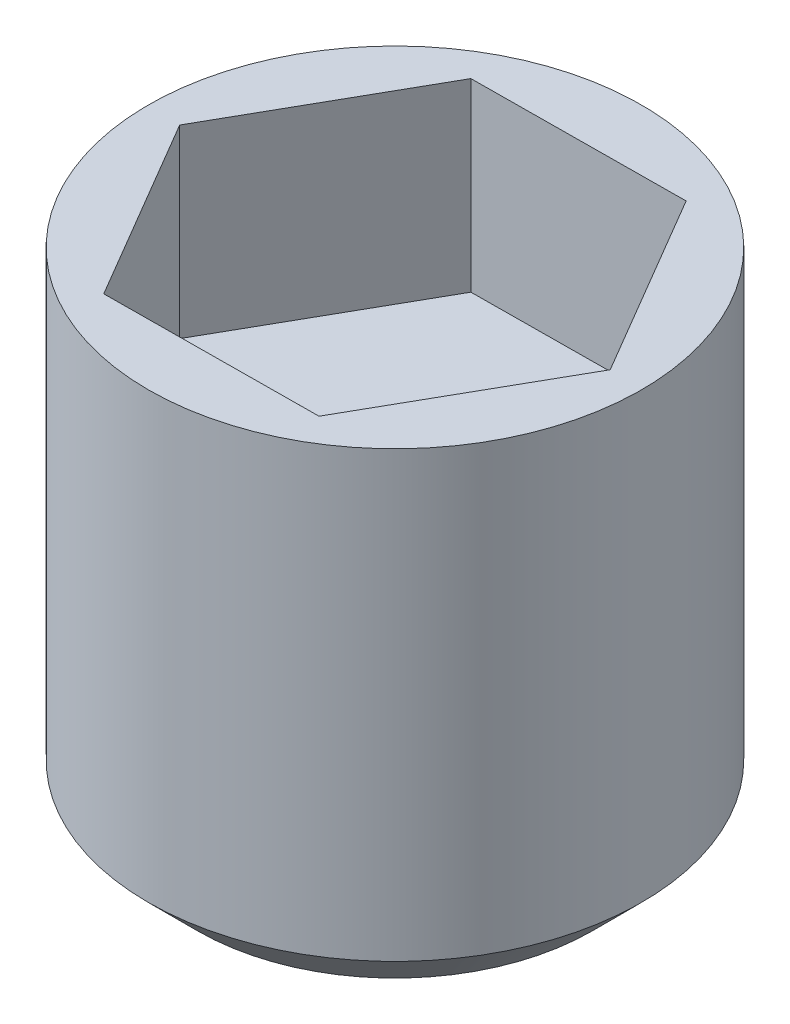
ISO-10303-21;
HEADER;
FILE_DESCRIPTION(('STEP AP214'),'2;1');
FILE_NAME('part.step','',(''),(''),'','','');
FILE_SCHEMA(('AUTOMOTIVE_DESIGN { 1 0 10303 214 1 1 1 1 }'));
ENDSEC;
DATA;
#1=APPLICATION_CONTEXT('core data for automotive mechanical design processes');
#2=APPLICATION_PROTOCOL_DEFINITION('international standard','automotive_design',2000,#1);
#3=PRODUCT_CONTEXT('',#1,'mechanical');
#4=PRODUCT('Part','Part','',(#3));
#5=PRODUCT_RELATED_PRODUCT_CATEGORY('part','',(#4));
#6=PRODUCT_DEFINITION_FORMATION('','',#4);
#7=PRODUCT_DEFINITION_CONTEXT('part definition',#1,'design');
#8=PRODUCT_DEFINITION('design','',#6,#7);
#9=PRODUCT_DEFINITION_SHAPE('','',#8);
#10=(LENGTH_UNIT() NAMED_UNIT(*) SI_UNIT(.MILLI.,.METRE.));
#11=(NAMED_UNIT(*) PLANE_ANGLE_UNIT() SI_UNIT($,.RADIAN.));
#12=(NAMED_UNIT(*) SI_UNIT($,.STERADIAN.) SOLID_ANGLE_UNIT());
#13=UNCERTAINTY_MEASURE_WITH_UNIT(LENGTH_MEASURE(1.E-05),#10,'distance_accuracy_value','');
#14=(GEOMETRIC_REPRESENTATION_CONTEXT(3) GLOBAL_UNCERTAINTY_ASSIGNED_CONTEXT((#13)) GLOBAL_UNIT_ASSIGNED_CONTEXT((#10,
#11,#12)) REPRESENTATION_CONTEXT('',''));
#15=CARTESIAN_POINT('',(0.,0.,0.));
#16=DIRECTION('',(0.,0.,1.));
#17=DIRECTION('',(1.,0.,0.));
#18=AXIS2_PLACEMENT_3D('',#15,#16,#17);
#19=CARTESIAN_POINT('',(0.,0.,0.));
#20=DIRECTION('',(0.,1.,0.));
#21=DIRECTION('',(0.,0.,1.));
#22=AXIS2_PLACEMENT_3D('',#19,#20,#21);
#23=PLANE('',#22);
#24=CARTESIAN_POINT('',(0.,0.,0.));
#25=DIRECTION('',(0.,1.,0.));
#26=DIRECTION('',(0.,0.,1.));
#27=AXIS2_PLACEMENT_3D('',#24,#25,#26);
#28=CIRCLE('',#27,3.2);
#29=CARTESIAN_POINT('',(0.,0.,3.2));
#30=VERTEX_POINT('',#29);
#31=EDGE_CURVE('E11',#30,#30,#28,.T.);
#32=ORIENTED_EDGE('',*,*,#31,.F.);
#33=EDGE_LOOP('',(#32));
#34=FACE_BOUND('',#33,.T.);
#35=ADVANCED_FACE('F35',(#34),#23,.F.);
#36=CARTESIAN_POINT('',(0.,0.,0.));
#37=DIRECTION('',(0.,1.,0.));
#38=DIRECTION('',(0.,0.,1.));
#39=AXIS2_PLACEMENT_3D('',#36,#37,#38);
#40=CONICAL_SURFACE('',#39,3.2,0.785398163397451);
#41=CARTESIAN_POINT('',(0.,0.799999999999995,0.));
#42=DIRECTION('',(0.,1.,0.));
#43=DIRECTION('',(0.,0.,1.));
#44=AXIS2_PLACEMENT_3D('',#41,#42,#43);
#45=CIRCLE('',#44,4.);
#46=CARTESIAN_POINT('',(0.,0.799999999999995,4.));
#47=VERTEX_POINT('',#46);
#48=EDGE_CURVE('E42',#47,#47,#45,.T.);
#49=ORIENTED_EDGE('',*,*,#48,.F.);
#50=EDGE_LOOP('',(#49));
#51=FACE_BOUND('',#50,.T.);
#52=ORIENTED_EDGE('',*,*,#31,.T.);
#53=EDGE_LOOP('',(#52));
#54=FACE_BOUND('',#53,.T.);
#55=ADVANCED_FACE('F148',(#51,#54),#40,.T.);
#56=CARTESIAN_POINT('',(0.,68.6445759886598,0.));
#57=DIRECTION('',(0.,1.,0.));
#58=DIRECTION('',(0.,0.,1.));
#59=AXIS2_PLACEMENT_3D('',#56,#57,#58);
#60=CYLINDRICAL_SURFACE('',#59,4.);
#61=CARTESIAN_POINT('',(0.,8.,0.));
#62=DIRECTION('',(0.,1.,0.));
#63=DIRECTION('',(0.,0.,1.));
#64=AXIS2_PLACEMENT_3D('',#61,#62,#63);
#65=CIRCLE('',#64,4.);
#66=CARTESIAN_POINT('',(0.,8.,4.));
#67=VERTEX_POINT('',#66);
#68=EDGE_CURVE('E136',#67,#67,#65,.T.);
#69=ORIENTED_EDGE('',*,*,#68,.F.);
#70=EDGE_LOOP('',(#69));
#71=FACE_BOUND('',#70,.T.);
#72=ORIENTED_EDGE('',*,*,#48,.T.);
#73=EDGE_LOOP('',(#72));
#74=FACE_BOUND('',#73,.T.);
#75=ADVANCED_FACE('F146',(#71,#74),#60,.T.);
#76=CARTESIAN_POINT('',(4.,8.,0.));
#77=DIRECTION('',(0.,-1.,0.));
#78=DIRECTION('',(0.,0.,-1.));
#79=AXIS2_PLACEMENT_3D('',#76,#77,#78);
#80=PLANE('',#79);
#81=DIRECTION('',(0.493268448593922,0.,-0.869877139383341));
#82=VECTOR('',#81,1.);
#83=CARTESIAN_POINT('',(1.75526540341467,8.,2.98647674753639));
#84=LINE('',#83,#82);
#85=CARTESIAN_POINT('',(1.75526540341467,8.,2.98647674753639));
#86=VERTEX_POINT('',#85);
#87=CARTESIAN_POINT('',(3.46399743288537,8.,-0.0268660559728551));
#88=VERTEX_POINT('',#87);
#89=EDGE_CURVE('E123',#86,#88,#84,.T.);
#90=ORIENTED_EDGE('',*,*,#89,.F.);
#91=DIRECTION('',(0.999969925174272,0.,-0.00775556232399564));
#92=VECTOR('',#91,1.);
#93=CARTESIAN_POINT('',(-1.7087320294707,8.,3.01334280350924));
#94=LINE('',#93,#92);
#95=CARTESIAN_POINT('',(-1.7087320294707,8.,3.01334280350924));
#96=VERTEX_POINT('',#95);
#97=EDGE_CURVE('E49',#96,#86,#94,.T.);
#98=ORIENTED_EDGE('',*,*,#97,.F.);
#99=DIRECTION('',(0.506701476580349,0.,0.862121577059346));
#100=VECTOR('',#99,1.);
#101=CARTESIAN_POINT('',(-3.46399743288537,8.,0.0268660559728533));
#102=LINE('',#101,#100);
#103=CARTESIAN_POINT('',(-3.46399743288537,8.,0.0268660559728533));
#104=VERTEX_POINT('',#103);
#105=EDGE_CURVE('E132',#104,#96,#102,.T.);
#106=ORIENTED_EDGE('',*,*,#105,.F.);
#107=DIRECTION('',(-0.493268448593922,0.,0.869877139383341));
#108=VECTOR('',#107,1.);
#109=CARTESIAN_POINT('',(-1.75526540341467,8.,-2.98647674753639));
#110=LINE('',#109,#108);
#111=CARTESIAN_POINT('',(-1.75526540341467,8.,-2.98647674753639));
#112=VERTEX_POINT('',#111);
#113=EDGE_CURVE('E130',#112,#104,#110,.T.);
#114=ORIENTED_EDGE('',*,*,#113,.F.);
#115=DIRECTION('',(-0.999969925174272,0.,0.0077555623239955));
#116=VECTOR('',#115,1.);
#117=CARTESIAN_POINT('',(1.7087320294707,8.,-3.01334280350924));
#118=LINE('',#117,#116);
#119=CARTESIAN_POINT('',(1.7087320294707,8.,-3.01334280350924));
#120=VERTEX_POINT('',#119);
#121=EDGE_CURVE('E97',#120,#112,#118,.T.);
#122=ORIENTED_EDGE('',*,*,#121,.F.);
#123=DIRECTION('',(-0.506701476580349,0.,-0.862121577059346));
#124=VECTOR('',#123,1.);
#125=CARTESIAN_POINT('',(3.46399743288537,8.,-0.0268660559728551));
#126=LINE('',#125,#124);
#127=EDGE_CURVE('E126',#88,#120,#126,.T.);
#128=ORIENTED_EDGE('',*,*,#127,.F.);
#129=EDGE_LOOP('',(#90,#98,#106,#114,#122,#128));
#130=FACE_BOUND('',#129,.T.);
#131=ORIENTED_EDGE('',*,*,#68,.T.);
#132=EDGE_LOOP('',(#131));
#133=FACE_BOUND('',#132,.T.);
#134=ADVANCED_FACE('F166',(#130,#133),#80,.F.);
#135=CARTESIAN_POINT('',(-1.7087320294707,5.,3.01334280350924));
#136=DIRECTION('',(0.00775556232399564,0.,0.999969925174272));
#137=DIRECTION('',(0.999969925174272,0.,-0.00775556232399564));
#138=AXIS2_PLACEMENT_3D('',#135,#136,#137);
#139=PLANE('',#138);
#140=ORIENTED_EDGE('',*,*,#97,.T.);
#141=DIRECTION('',(0.,1.,0.));
#142=VECTOR('',#141,1.);
#143=CARTESIAN_POINT('',(1.75526540341467,5.,2.98647674753639));
#144=LINE('',#143,#142);
#145=CARTESIAN_POINT('',(1.75526540341467,5.,2.98647674753639));
#146=VERTEX_POINT('',#145);
#147=EDGE_CURVE('E79',#146,#86,#144,.T.);
#148=ORIENTED_EDGE('',*,*,#147,.F.);
#149=DIRECTION('',(0.999969925174272,0.,-0.00775556232399564));
#150=VECTOR('',#149,1.);
#151=CARTESIAN_POINT('',(-1.7087320294707,5.,3.01334280350924));
#152=LINE('',#151,#150);
#153=CARTESIAN_POINT('',(-1.7087320294707,5.,3.01334280350924));
#154=VERTEX_POINT('',#153);
#155=EDGE_CURVE('E134',#154,#146,#152,.T.);
#156=ORIENTED_EDGE('',*,*,#155,.F.);
#157=DIRECTION('',(0.,1.,0.));
#158=VECTOR('',#157,1.);
#159=CARTESIAN_POINT('',(-1.7087320294707,5.,3.01334280350924));
#160=LINE('',#159,#158);
#161=EDGE_CURVE('E57',#154,#96,#160,.T.);
#162=ORIENTED_EDGE('',*,*,#161,.T.);
#163=EDGE_LOOP('',(#140,#148,#156,#162));
#164=FACE_BOUND('',#163,.T.);
#165=ADVANCED_FACE('F174',(#164),#139,.F.);
#166=CARTESIAN_POINT('',(-3.46399743288537,5.,0.0268660559728533));
#167=DIRECTION('',(-0.862121577059346,0.,0.506701476580349));
#168=DIRECTION('',(0.506701476580349,0.,0.862121577059346));
#169=AXIS2_PLACEMENT_3D('',#166,#167,#168);
#170=PLANE('',#169);
#171=ORIENTED_EDGE('',*,*,#105,.T.);
#172=ORIENTED_EDGE('',*,*,#161,.F.);
#173=DIRECTION('',(0.506701476580349,0.,0.862121577059346));
#174=VECTOR('',#173,1.);
#175=CARTESIAN_POINT('',(-3.46399743288537,5.,0.0268660559728533));
#176=LINE('',#175,#174);
#177=CARTESIAN_POINT('',(-3.46399743288537,5.,0.0268660559728533));
#178=VERTEX_POINT('',#177);
#179=EDGE_CURVE('E109',#178,#154,#176,.T.);
#180=ORIENTED_EDGE('',*,*,#179,.F.);
#181=DIRECTION('',(0.,1.,0.));
#182=VECTOR('',#181,1.);
#183=CARTESIAN_POINT('',(-3.46399743288537,5.,0.0268660559728533));
#184=LINE('',#183,#182);
#185=EDGE_CURVE('E101',#178,#104,#184,.T.);
#186=ORIENTED_EDGE('',*,*,#185,.T.);
#187=EDGE_LOOP('',(#171,#172,#180,#186));
#188=FACE_BOUND('',#187,.T.);
#189=ADVANCED_FACE('F182',(#188),#170,.F.);
#190=CARTESIAN_POINT('',(-1.75526540341467,5.,-2.98647674753639));
#191=DIRECTION('',(-0.869877139383341,0.,-0.493268448593922));
#192=DIRECTION('',(-0.493268448593922,0.,0.869877139383342));
#193=AXIS2_PLACEMENT_3D('',#190,#191,#192);
#194=PLANE('',#193);
#195=ORIENTED_EDGE('',*,*,#113,.T.);
#196=ORIENTED_EDGE('',*,*,#185,.F.);
#197=DIRECTION('',(-0.493268448593922,0.,0.869877139383341));
#198=VECTOR('',#197,1.);
#199=CARTESIAN_POINT('',(-1.75526540341467,5.,-2.98647674753639));
#200=LINE('',#199,#198);
#201=CARTESIAN_POINT('',(-1.75526540341467,5.,-2.98647674753639));
#202=VERTEX_POINT('',#201);
#203=EDGE_CURVE('E105',#202,#178,#200,.T.);
#204=ORIENTED_EDGE('',*,*,#203,.F.);
#205=DIRECTION('',(0.,1.,0.));
#206=VECTOR('',#205,1.);
#207=CARTESIAN_POINT('',(-1.75526540341467,5.,-2.98647674753639));
#208=LINE('',#207,#206);
#209=EDGE_CURVE('E90',#202,#112,#208,.T.);
#210=ORIENTED_EDGE('',*,*,#209,.T.);
#211=EDGE_LOOP('',(#195,#196,#204,#210));
#212=FACE_BOUND('',#211,.T.);
#213=ADVANCED_FACE('F106',(#212),#194,.F.);
#214=CARTESIAN_POINT('',(1.7087320294707,5.,-3.01334280350924));
#215=DIRECTION('',(-0.00775556232399551,0.,-0.999969925174272));
#216=DIRECTION('',(-0.999969925174272,0.,0.00775556232399551));
#217=AXIS2_PLACEMENT_3D('',#214,#215,#216);
#218=PLANE('',#217);
#219=ORIENTED_EDGE('',*,*,#121,.T.);
#220=ORIENTED_EDGE('',*,*,#209,.F.);
#221=DIRECTION('',(-0.999969925174272,0.,0.0077555623239955));
#222=VECTOR('',#221,1.);
#223=CARTESIAN_POINT('',(1.7087320294707,5.,-3.01334280350924));
#224=LINE('',#223,#222);
#225=CARTESIAN_POINT('',(1.7087320294707,5.,-3.01334280350924));
#226=VERTEX_POINT('',#225);
#227=EDGE_CURVE('E94',#226,#202,#224,.T.);
#228=ORIENTED_EDGE('',*,*,#227,.F.);
#229=DIRECTION('',(0.,1.,0.));
#230=VECTOR('',#229,1.);
#231=CARTESIAN_POINT('',(1.7087320294707,5.,-3.01334280350924));
#232=LINE('',#231,#230);
#233=EDGE_CURVE('E102',#226,#120,#232,.T.);
#234=ORIENTED_EDGE('',*,*,#233,.T.);
#235=EDGE_LOOP('',(#219,#220,#228,#234));
#236=FACE_BOUND('',#235,.T.);
#237=ADVANCED_FACE('F92',(#236),#218,.F.);
#238=CARTESIAN_POINT('',(3.46399743288537,5.,-0.0268660559728551));
#239=DIRECTION('',(0.862121577059346,0.,-0.50670147658035));
#240=DIRECTION('',(-0.50670147658035,0.,-0.862121577059346));
#241=AXIS2_PLACEMENT_3D('',#238,#239,#240);
#242=PLANE('',#241);
#243=ORIENTED_EDGE('',*,*,#127,.T.);
#244=ORIENTED_EDGE('',*,*,#233,.F.);
#245=DIRECTION('',(-0.506701476580349,0.,-0.862121577059346));
#246=VECTOR('',#245,1.);
#247=CARTESIAN_POINT('',(3.46399743288537,5.,-0.0268660559728551));
#248=LINE('',#247,#246);
#249=CARTESIAN_POINT('',(3.46399743288537,5.,-0.0268660559728551));
#250=VERTEX_POINT('',#249);
#251=EDGE_CURVE('E115',#250,#226,#248,.T.);
#252=ORIENTED_EDGE('',*,*,#251,.F.);
#253=DIRECTION('',(0.,1.,0.));
#254=VECTOR('',#253,1.);
#255=CARTESIAN_POINT('',(3.46399743288537,5.,-0.0268660559728551));
#256=LINE('',#255,#254);
#257=EDGE_CURVE('E139',#250,#88,#256,.T.);
#258=ORIENTED_EDGE('',*,*,#257,.T.);
#259=EDGE_LOOP('',(#243,#244,#252,#258));
#260=FACE_BOUND('',#259,.T.);
#261=ADVANCED_FACE('F201',(#260),#242,.F.);
#262=CARTESIAN_POINT('',(1.75526540341467,5.,2.98647674753639));
#263=DIRECTION('',(0.869877139383341,0.,0.493268448593922));
#264=DIRECTION('',(0.493268448593922,0.,-0.869877139383342));
#265=AXIS2_PLACEMENT_3D('',#262,#263,#264);
#266=PLANE('',#265);
#267=ORIENTED_EDGE('',*,*,#89,.T.);
#268=ORIENTED_EDGE('',*,*,#257,.F.);
#269=DIRECTION('',(0.493268448593922,0.,-0.869877139383341));
#270=VECTOR('',#269,1.);
#271=CARTESIAN_POINT('',(1.75526540341467,5.,2.98647674753639));
#272=LINE('',#271,#270);
#273=EDGE_CURVE('E117',#146,#250,#272,.T.);
#274=ORIENTED_EDGE('',*,*,#273,.F.);
#275=ORIENTED_EDGE('',*,*,#147,.T.);
#276=EDGE_LOOP('',(#267,#268,#274,#275));
#277=FACE_BOUND('',#276,.T.);
#278=ADVANCED_FACE('F208',(#277),#266,.F.);
#279=CARTESIAN_POINT('',(0.,5.,0.));
#280=DIRECTION('',(0.,1.,0.));
#281=DIRECTION('',(0.,0.,1.));
#282=AXIS2_PLACEMENT_3D('',#279,#280,#281);
#283=PLANE('',#282);
#284=ORIENTED_EDGE('',*,*,#155,.T.);
#285=ORIENTED_EDGE('',*,*,#273,.T.);
#286=ORIENTED_EDGE('',*,*,#251,.T.);
#287=ORIENTED_EDGE('',*,*,#227,.T.);
#288=ORIENTED_EDGE('',*,*,#203,.T.);
#289=ORIENTED_EDGE('',*,*,#179,.T.);
#290=EDGE_LOOP('',(#284,#285,#286,#287,#288,#289));
#291=FACE_BOUND('',#290,.T.);
#292=ADVANCED_FACE('F112',(#291),#283,.T.);
#293=CLOSED_SHELL('',(#35,#55,#75,#134,#165,#189,#213,#237,#261,#278,#292));
#294=MANIFOLD_SOLID_BREP('B2',#293);
#295=ADVANCED_BREP_SHAPE_REPRESENTATION('',(#18,#294),#14);
#296=SHAPE_DEFINITION_REPRESENTATION(#9,#295);
ENDSEC;
END-ISO-10303-21;
